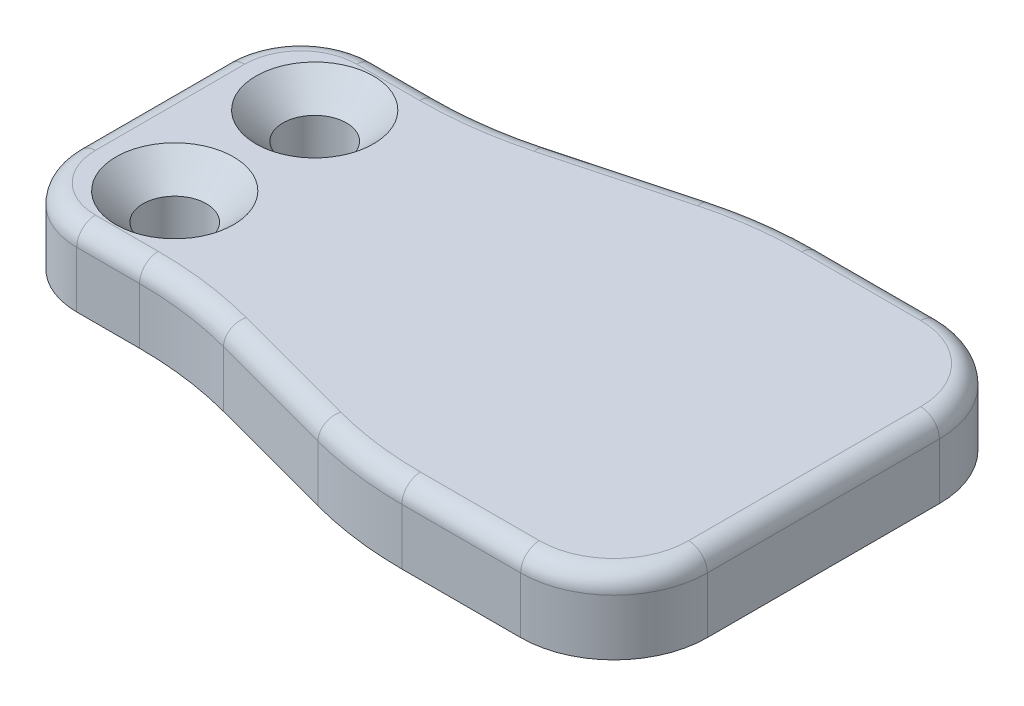
ISO-10303-21;
HEADER;
FILE_DESCRIPTION(('STEP AP214'),'2;1');
FILE_NAME('part.step','',(''),(''),'','','');
FILE_SCHEMA(('AUTOMOTIVE_DESIGN { 1 0 10303 214 1 1 1 1 }'));
ENDSEC;
DATA;
#1=APPLICATION_CONTEXT('core data for automotive mechanical design processes');
#2=APPLICATION_PROTOCOL_DEFINITION('international standard','automotive_design',2000,#1);
#3=PRODUCT_CONTEXT('',#1,'mechanical');
#4=PRODUCT('Part','Part','',(#3));
#5=PRODUCT_RELATED_PRODUCT_CATEGORY('part','',(#4));
#6=PRODUCT_DEFINITION_FORMATION('','',#4);
#7=PRODUCT_DEFINITION_CONTEXT('part definition',#1,'design');
#8=PRODUCT_DEFINITION('design','',#6,#7);
#9=PRODUCT_DEFINITION_SHAPE('','',#8);
#10=(LENGTH_UNIT() NAMED_UNIT(*) SI_UNIT(.MILLI.,.METRE.));
#11=(NAMED_UNIT(*) PLANE_ANGLE_UNIT() SI_UNIT($,.RADIAN.));
#12=(NAMED_UNIT(*) SI_UNIT($,.STERADIAN.) SOLID_ANGLE_UNIT());
#13=UNCERTAINTY_MEASURE_WITH_UNIT(LENGTH_MEASURE(1.E-05),#10,'distance_accuracy_value','');
#14=(GEOMETRIC_REPRESENTATION_CONTEXT(3) GLOBAL_UNCERTAINTY_ASSIGNED_CONTEXT((#13)) GLOBAL_UNIT_ASSIGNED_CONTEXT((#10,
#11,#12)) REPRESENTATION_CONTEXT('',''));
#15=CARTESIAN_POINT('',(0.,0.,0.));
#16=DIRECTION('',(0.,0.,1.));
#17=DIRECTION('',(1.,0.,0.));
#18=AXIS2_PLACEMENT_3D('',#15,#16,#17);
#19=CARTESIAN_POINT('',(36.,-2.,0.));
#20=DIRECTION('',(1.,0.,0.));
#21=DIRECTION('',(0.,0.,-1.));
#22=AXIS2_PLACEMENT_3D('',#19,#20,#21);
#23=PLANE('',#22);
#24=DIRECTION('',(0.,-1.,0.));
#25=VECTOR('',#24,1.);
#26=CARTESIAN_POINT('',(36.,-2.,31.7596196090394));
#27=LINE('',#26,#25);
#28=CARTESIAN_POINT('',(36.,-6.,31.7596196090394));
#29=VERTEX_POINT('',#28);
#30=CARTESIAN_POINT('',(36.,-3.,31.7596196090394));
#31=VERTEX_POINT('',#30);
#32=EDGE_CURVE('E289',#29,#31,#27,.F.);
#33=ORIENTED_EDGE('',*,*,#32,.T.);
#34=DIRECTION('',(0.,0.,1.));
#35=VECTOR('',#34,1.);
#36=CARTESIAN_POINT('',(36.,-3.,44.1904002273864));
#37=LINE('',#36,#35);
#38=CARTESIAN_POINT('',(36.,-3.,44.1904002273864));
#39=VERTEX_POINT('',#38);
#40=EDGE_CURVE('E11',#31,#39,#37,.T.);
#41=ORIENTED_EDGE('',*,*,#40,.T.);
#42=DIRECTION('',(0.,-1.,0.));
#43=VECTOR('',#42,1.);
#44=CARTESIAN_POINT('',(36.,-6.,44.1904002273864));
#45=LINE('',#44,#43);
#46=CARTESIAN_POINT('',(36.,-6.,44.1904002273864));
#47=VERTEX_POINT('',#46);
#48=EDGE_CURVE('E291',#39,#47,#45,.T.);
#49=ORIENTED_EDGE('',*,*,#48,.T.);
#50=DIRECTION('',(0.,0.,1.));
#51=VECTOR('',#50,1.);
#52=CARTESIAN_POINT('',(36.,-6.,0.));
#53=LINE('',#52,#51);
#54=EDGE_CURVE('E250',#29,#47,#53,.T.);
#55=ORIENTED_EDGE('',*,*,#54,.F.);
#56=EDGE_LOOP('',(#33,#41,#49,#55));
#57=FACE_BOUND('',#56,.T.);
#58=ADVANCED_FACE('F39',(#57),#23,.T.);
#59=CARTESIAN_POINT('',(0.,-2.,26.7596196090394));
#60=DIRECTION('',(0.,0.,-1.));
#61=DIRECTION('',(-1.,0.,0.));
#62=AXIS2_PLACEMENT_3D('',#59,#60,#61);
#63=PLANE('',#62);
#64=DIRECTION('',(0.,-1.,0.));
#65=VECTOR('',#64,1.);
#66=CARTESIAN_POINT('',(24.6330499517479,-2.,26.7596196090394));
#67=LINE('',#66,#65);
#68=CARTESIAN_POINT('',(24.6330499517479,-6.,26.7596196090394));
#69=VERTEX_POINT('',#68);
#70=CARTESIAN_POINT('',(24.6330499517479,-3.,26.7596196090394));
#71=VERTEX_POINT('',#70);
#72=EDGE_CURVE('E281',#69,#71,#67,.F.);
#73=ORIENTED_EDGE('',*,*,#72,.T.);
#74=DIRECTION('',(1.,0.,0.));
#75=VECTOR('',#74,1.);
#76=CARTESIAN_POINT('',(31.,-3.,26.7596196090394));
#77=LINE('',#76,#75);
#78=CARTESIAN_POINT('',(31.,-3.,26.7596196090394));
#79=VERTEX_POINT('',#78);
#80=EDGE_CURVE('E337',#71,#79,#77,.T.);
#81=ORIENTED_EDGE('',*,*,#80,.T.);
#82=DIRECTION('',(0.,-1.,0.));
#83=VECTOR('',#82,1.);
#84=CARTESIAN_POINT('',(31.,-2.,26.7596196090394));
#85=LINE('',#84,#83);
#86=CARTESIAN_POINT('',(31.,-6.,26.7596196090394));
#87=VERTEX_POINT('',#86);
#88=EDGE_CURVE('E299',#79,#87,#85,.T.);
#89=ORIENTED_EDGE('',*,*,#88,.T.);
#90=DIRECTION('',(1.,0.,0.));
#91=VECTOR('',#90,1.);
#92=CARTESIAN_POINT('',(0.,-6.,26.7596196090394));
#93=LINE('',#92,#91);
#94=EDGE_CURVE('E213',#69,#87,#93,.T.);
#95=ORIENTED_EDGE('',*,*,#94,.F.);
#96=EDGE_LOOP('',(#73,#81,#89,#95));
#97=FACE_BOUND('',#96,.T.);
#98=ADVANCED_FACE('F532',(#97),#63,.T.);
#99=CARTESIAN_POINT('',(8.16362546063105,-2.,30.4670649930379));
#100=DIRECTION('',(-0.258819045102521,0.,-0.965925826289068));
#101=DIRECTION('',(-0.965925826289068,0.,0.258819045102521));
#102=AXIS2_PLACEMENT_3D('',#99,#100,#101);
#103=PLANE('',#102);
#104=DIRECTION('',(0.,-1.,0.));
#105=VECTOR('',#104,1.);
#106=CARTESIAN_POINT('',(12.5433309503025,-2.,29.2935264439943));
#107=LINE('',#106,#105);
#108=CARTESIAN_POINT('',(12.5433309503025,-6.,29.2935264439943));
#109=VERTEX_POINT('',#108);
#110=CARTESIAN_POINT('',(12.5433309503025,-3.,29.2935264439943));
#111=VERTEX_POINT('',#110);
#112=EDGE_CURVE('E276',#109,#111,#107,.F.);
#113=ORIENTED_EDGE('',*,*,#112,.T.);
#114=DIRECTION('',(0.965925826289068,0.,-0.258819045102521));
#115=VECTOR('',#114,1.);
#116=CARTESIAN_POINT('',(19.4566690496975,-3.,27.441103083258));
#117=LINE('',#116,#115);
#118=CARTESIAN_POINT('',(19.4566690496975,-3.,27.441103083258));
#119=VERTEX_POINT('',#118);
#120=EDGE_CURVE('E341',#111,#119,#117,.T.);
#121=ORIENTED_EDGE('',*,*,#120,.T.);
#122=DIRECTION('',(0.,-1.,0.));
#123=VECTOR('',#122,1.);
#124=CARTESIAN_POINT('',(19.4566690496975,-2.,27.441103083258));
#125=LINE('',#124,#123);
#126=CARTESIAN_POINT('',(19.4566690496975,-6.,27.441103083258));
#127=VERTEX_POINT('',#126);
#128=EDGE_CURVE('E279',#119,#127,#125,.T.);
#129=ORIENTED_EDGE('',*,*,#128,.T.);
#130=DIRECTION('',(0.965925826289068,0.,-0.258819045102521));
#131=VECTOR('',#130,1.);
#132=CARTESIAN_POINT('',(8.16362546063105,-6.,30.4670649930379));
#133=LINE('',#132,#131);
#134=EDGE_CURVE('E242',#109,#127,#133,.T.);
#135=ORIENTED_EDGE('',*,*,#134,.F.);
#136=EDGE_LOOP('',(#113,#121,#129,#135));
#137=FACE_BOUND('',#136,.T.);
#138=ADVANCED_FACE('F521',(#137),#103,.T.);
#139=CARTESIAN_POINT('',(0.,-2.,29.9750099182129));
#140=DIRECTION('',(0.,0.,-1.));
#141=DIRECTION('',(-1.,0.,0.));
#142=AXIS2_PLACEMENT_3D('',#139,#140,#141);
#143=PLANE('',#142);
#144=DIRECTION('',(0.,-1.,0.));
#145=VECTOR('',#144,1.);
#146=CARTESIAN_POINT('',(4.,-2.,29.9750099182129));
#147=LINE('',#146,#145);
#148=CARTESIAN_POINT('',(4.,-6.,29.9750099182129));
#149=VERTEX_POINT('',#148);
#150=CARTESIAN_POINT('',(4.,-3.,29.9750099182129));
#151=VERTEX_POINT('',#150);
#152=EDGE_CURVE('E260',#149,#151,#147,.F.);
#153=ORIENTED_EDGE('',*,*,#152,.T.);
#154=DIRECTION('',(1.,0.,0.));
#155=VECTOR('',#154,1.);
#156=CARTESIAN_POINT('',(7.36695004825207,-3.,29.9750099182129));
#157=LINE('',#156,#155);
#158=CARTESIAN_POINT('',(7.36695004825207,-3.,29.9750099182129));
#159=VERTEX_POINT('',#158);
#160=EDGE_CURVE('E345',#151,#159,#157,.T.);
#161=ORIENTED_EDGE('',*,*,#160,.T.);
#162=DIRECTION('',(0.,-1.,0.));
#163=VECTOR('',#162,1.);
#164=CARTESIAN_POINT('',(7.36695004825207,-6.,29.9750099182129));
#165=LINE('',#164,#163);
#166=CARTESIAN_POINT('',(7.36695004825207,-6.,29.9750099182129));
#167=VERTEX_POINT('',#166);
#168=EDGE_CURVE('E284',#159,#167,#165,.T.);
#169=ORIENTED_EDGE('',*,*,#168,.T.);
#170=DIRECTION('',(1.,0.,0.));
#171=VECTOR('',#170,1.);
#172=CARTESIAN_POINT('',(0.,-6.,29.9750099182129));
#173=LINE('',#172,#171);
#174=EDGE_CURVE('E233',#149,#167,#173,.T.);
#175=ORIENTED_EDGE('',*,*,#174,.F.);
#176=EDGE_LOOP('',(#153,#161,#169,#175));
#177=FACE_BOUND('',#176,.T.);
#178=ADVANCED_FACE('F500',(#177),#143,.T.);
#179=CARTESIAN_POINT('',(0.,-2.,0.));
#180=DIRECTION('',(-1.,0.,0.));
#181=DIRECTION('',(0.,0.,1.));
#182=AXIS2_PLACEMENT_3D('',#179,#180,#181);
#183=PLANE('',#182);
#184=DIRECTION('',(0.,-1.,0.));
#185=VECTOR('',#184,1.);
#186=CARTESIAN_POINT('',(0.,-2.,41.9750099182129));
#187=LINE('',#186,#185);
#188=CARTESIAN_POINT('',(0.,-6.,41.9750099182129));
#189=VERTEX_POINT('',#188);
#190=CARTESIAN_POINT('',(0.,-3.,41.9750099182129));
#191=VERTEX_POINT('',#190);
#192=EDGE_CURVE('E219',#189,#191,#187,.F.);
#193=ORIENTED_EDGE('',*,*,#192,.T.);
#194=DIRECTION('',(0.,0.,-1.));
#195=VECTOR('',#194,1.);
#196=CARTESIAN_POINT('',(0.,-3.,33.9750099182129));
#197=LINE('',#196,#195);
#198=CARTESIAN_POINT('',(0.,-3.,33.9750099182129));
#199=VERTEX_POINT('',#198);
#200=EDGE_CURVE('E349',#191,#199,#197,.T.);
#201=ORIENTED_EDGE('',*,*,#200,.T.);
#202=DIRECTION('',(0.,-1.,0.));
#203=VECTOR('',#202,1.);
#204=CARTESIAN_POINT('',(0.,-2.,33.9750099182129));
#205=LINE('',#204,#203);
#206=CARTESIAN_POINT('',(0.,-6.,33.9750099182129));
#207=VERTEX_POINT('',#206);
#208=EDGE_CURVE('E223',#199,#207,#205,.T.);
#209=ORIENTED_EDGE('',*,*,#208,.T.);
#210=DIRECTION('',(0.,0.,-1.));
#211=VECTOR('',#210,1.);
#212=CARTESIAN_POINT('',(0.,-6.,0.));
#213=LINE('',#212,#211);
#214=EDGE_CURVE('E230',#189,#207,#213,.T.);
#215=ORIENTED_EDGE('',*,*,#214,.F.);
#216=EDGE_LOOP('',(#193,#201,#209,#215));
#217=FACE_BOUND('',#216,.T.);
#218=ADVANCED_FACE('F493',(#217),#183,.T.);
#219=CARTESIAN_POINT('',(0.,-2.,45.9750099182129));
#220=DIRECTION('',(0.,0.,-1.));
#221=DIRECTION('',(-1.,0.,0.));
#222=AXIS2_PLACEMENT_3D('',#219,#220,#221);
#223=PLANE('',#222);
#224=DIRECTION('',(0.,-1.,0.));
#225=VECTOR('',#224,1.);
#226=CARTESIAN_POINT('',(7.36695004825208,-2.,45.9750099182129));
#227=LINE('',#226,#225);
#228=CARTESIAN_POINT('',(7.36695004825208,-6.,45.9750099182129));
#229=VERTEX_POINT('',#228);
#230=CARTESIAN_POINT('',(7.36695004825208,-3.,45.9750099182129));
#231=VERTEX_POINT('',#230);
#232=EDGE_CURVE('E274',#229,#231,#227,.F.);
#233=ORIENTED_EDGE('',*,*,#232,.T.);
#234=DIRECTION('',(1.,0.,0.));
#235=VECTOR('',#234,1.);
#236=CARTESIAN_POINT('',(0.,-3.,45.9750099182129));
#237=LINE('',#236,#235);
#238=CARTESIAN_POINT('',(4.,-3.,45.9750099182129));
#239=VERTEX_POINT('',#238);
#240=EDGE_CURVE('E209',#231,#239,#237,.F.);
#241=ORIENTED_EDGE('',*,*,#240,.T.);
#242=DIRECTION('',(0.,-1.,0.));
#243=VECTOR('',#242,1.);
#244=CARTESIAN_POINT('',(4.,-6.,45.9750099182129));
#245=LINE('',#244,#243);
#246=CARTESIAN_POINT('',(4.,-6.,45.9750099182129));
#247=VERTEX_POINT('',#246);
#248=EDGE_CURVE('E201',#239,#247,#245,.T.);
#249=ORIENTED_EDGE('',*,*,#248,.T.);
#250=DIRECTION('',(1.,0.,0.));
#251=VECTOR('',#250,1.);
#252=CARTESIAN_POINT('',(0.,-6.,45.9750099182129));
#253=LINE('',#252,#251);
#254=EDGE_CURVE('E206',#247,#229,#253,.T.);
#255=ORIENTED_EDGE('',*,*,#254,.T.);
#256=EDGE_LOOP('',(#233,#241,#249,#255));
#257=FACE_BOUND('',#256,.T.);
#258=ADVANCED_FACE('F204',(#257),#223,.F.);
#259=CARTESIAN_POINT('',(-10.8238794984754,-2.,40.3952682233134));
#260=DIRECTION('',(0.258819045102521,0.,-0.965925826289068));
#261=DIRECTION('',(-0.965925826289068,0.,-0.258819045102521));
#262=AXIS2_PLACEMENT_3D('',#259,#260,#261);
#263=PLANE('',#262);
#264=DIRECTION('',(0.,-1.,0.));
#265=VECTOR('',#264,1.);
#266=CARTESIAN_POINT('',(19.4566690496975,-2.,48.5089167531677));
#267=LINE('',#266,#265);
#268=CARTESIAN_POINT('',(19.4566690496975,-6.,48.5089167531677));
#269=VERTEX_POINT('',#268);
#270=CARTESIAN_POINT('',(19.4566690496975,-3.,48.5089167531677));
#271=VERTEX_POINT('',#270);
#272=EDGE_CURVE('E271',#269,#271,#267,.F.);
#273=ORIENTED_EDGE('',*,*,#272,.T.);
#274=DIRECTION('',(0.965925826289068,0.,0.258819045102521));
#275=VECTOR('',#274,1.);
#276=CARTESIAN_POINT('',(-10.8238794984754,-3.,40.3952682233134));
#277=LINE('',#276,#275);
#278=CARTESIAN_POINT('',(12.5433309503025,-3.,46.6564933924315));
#279=VERTEX_POINT('',#278);
#280=EDGE_CURVE('E356',#271,#279,#277,.F.);
#281=ORIENTED_EDGE('',*,*,#280,.T.);
#282=DIRECTION('',(0.,-1.,0.));
#283=VECTOR('',#282,1.);
#284=CARTESIAN_POINT('',(12.5433309503025,-6.,46.6564933924315));
#285=LINE('',#284,#283);
#286=CARTESIAN_POINT('',(12.5433309503025,-6.,46.6564933924315));
#287=VERTEX_POINT('',#286);
#288=EDGE_CURVE('E269',#279,#287,#285,.T.);
#289=ORIENTED_EDGE('',*,*,#288,.T.);
#290=DIRECTION('',(0.965925826289068,0.,0.258819045102521));
#291=VECTOR('',#290,1.);
#292=CARTESIAN_POINT('',(-10.8238794984754,-6.,40.3952682233134));
#293=LINE('',#292,#291);
#294=EDGE_CURVE('E231',#287,#269,#293,.T.);
#295=ORIENTED_EDGE('',*,*,#294,.T.);
#296=EDGE_LOOP('',(#273,#281,#289,#295));
#297=FACE_BOUND('',#296,.T.);
#298=ADVANCED_FACE('F481',(#297),#263,.F.);
#299=CARTESIAN_POINT('',(0.,-2.,49.1904002273864));
#300=DIRECTION('',(0.,0.,-1.));
#301=DIRECTION('',(-1.,0.,0.));
#302=AXIS2_PLACEMENT_3D('',#299,#300,#301);
#303=PLANE('',#302);
#304=DIRECTION('',(0.,-1.,0.));
#305=VECTOR('',#304,1.);
#306=CARTESIAN_POINT('',(31.,-2.,49.1904002273864));
#307=LINE('',#306,#305);
#308=CARTESIAN_POINT('',(31.,-6.,49.1904002273864));
#309=VERTEX_POINT('',#308);
#310=CARTESIAN_POINT('',(31.,-3.,49.1904002273864));
#311=VERTEX_POINT('',#310);
#312=EDGE_CURVE('E297',#309,#311,#307,.F.);
#313=ORIENTED_EDGE('',*,*,#312,.T.);
#314=DIRECTION('',(1.,0.,0.));
#315=VECTOR('',#314,1.);
#316=CARTESIAN_POINT('',(0.,-3.,49.1904002273864));
#317=LINE('',#316,#315);
#318=CARTESIAN_POINT('',(24.6330499517479,-3.,49.1904002273864));
#319=VERTEX_POINT('',#318);
#320=EDGE_CURVE('E360',#311,#319,#317,.F.);
#321=ORIENTED_EDGE('',*,*,#320,.T.);
#322=DIRECTION('',(0.,-1.,0.));
#323=VECTOR('',#322,1.);
#324=CARTESIAN_POINT('',(24.6330499517479,-2.,49.1904002273864));
#325=LINE('',#324,#323);
#326=CARTESIAN_POINT('',(24.6330499517479,-6.,49.1904002273864));
#327=VERTEX_POINT('',#326);
#328=EDGE_CURVE('E263',#319,#327,#325,.T.);
#329=ORIENTED_EDGE('',*,*,#328,.T.);
#330=DIRECTION('',(1.,0.,0.));
#331=VECTOR('',#330,1.);
#332=CARTESIAN_POINT('',(0.,-6.,49.1904002273864));
#333=LINE('',#332,#331);
#334=EDGE_CURVE('E236',#327,#309,#333,.T.);
#335=ORIENTED_EDGE('',*,*,#334,.T.);
#336=EDGE_LOOP('',(#313,#321,#329,#335));
#337=FACE_BOUND('',#336,.T.);
#338=ADVANCED_FACE('F427',(#337),#303,.F.);
#339=CARTESIAN_POINT('',(0.,-2.,0.));
#340=DIRECTION('',(0.,-1.,0.));
#341=DIRECTION('',(0.,0.,-1.));
#342=AXIS2_PLACEMENT_3D('',#339,#340,#341);
#343=PLANE('',#342);
#344=DIRECTION('',(0.,0.,1.));
#345=VECTOR('',#344,1.);
#346=CARTESIAN_POINT('',(35.,-2.,31.7596196090394));
#347=LINE('',#346,#345);
#348=CARTESIAN_POINT('',(35.,-2.,44.1904002273864));
#349=VERTEX_POINT('',#348);
#350=CARTESIAN_POINT('',(35.,-2.,31.7596196090394));
#351=VERTEX_POINT('',#350);
#352=EDGE_CURVE('E301',#349,#351,#347,.F.);
#353=ORIENTED_EDGE('',*,*,#352,.T.);
#354=CARTESIAN_POINT('',(31.,-2.,31.7596196090394));
#355=DIRECTION('',(0.,-1.,0.));
#356=DIRECTION('',(0.,0.,-1.));
#357=AXIS2_PLACEMENT_3D('',#354,#355,#356);
#358=CIRCLE('',#357,4.);
#359=CARTESIAN_POINT('',(31.,-2.,27.7596196090394));
#360=VERTEX_POINT('',#359);
#361=EDGE_CURVE('E331',#351,#360,#358,.F.);
#362=ORIENTED_EDGE('',*,*,#361,.T.);
#363=DIRECTION('',(1.,0.,0.));
#364=VECTOR('',#363,1.);
#365=CARTESIAN_POINT('',(24.6330499517479,-2.,27.7596196090394));
#366=LINE('',#365,#364);
#367=CARTESIAN_POINT('',(24.6330499517479,-2.,27.7596196090394));
#368=VERTEX_POINT('',#367);
#369=EDGE_CURVE('E329',#360,#368,#366,.F.);
#370=ORIENTED_EDGE('',*,*,#369,.T.);
#371=CARTESIAN_POINT('',(24.6330499517479,-2.,46.7596196090394));
#372=DIRECTION('',(0.,-1.,0.));
#373=DIRECTION('',(0.,0.,-1.));
#374=AXIS2_PLACEMENT_3D('',#371,#372,#373);
#375=CIRCLE('',#374,19.);
#376=CARTESIAN_POINT('',(19.7154880948,-2.,28.4070289095471));
#377=VERTEX_POINT('',#376);
#378=EDGE_CURVE('E327',#368,#377,#375,.F.);
#379=ORIENTED_EDGE('',*,*,#378,.T.);
#380=DIRECTION('',(0.965925826289068,0.,-0.258819045102521));
#381=VECTOR('',#380,1.);
#382=CARTESIAN_POINT('',(12.802149995405,-2.,30.2594522702833));
#383=LINE('',#382,#381);
#384=CARTESIAN_POINT('',(12.802149995405,-2.,30.2594522702833));
#385=VERTEX_POINT('',#384);
#386=EDGE_CURVE('E325',#377,#385,#383,.F.);
#387=ORIENTED_EDGE('',*,*,#386,.T.);
#388=CARTESIAN_POINT('',(7.36695004825207,-2.,9.97500991821289));
#389=DIRECTION('',(0.,-1.,0.));
#390=DIRECTION('',(0.,0.,-1.));
#391=AXIS2_PLACEMENT_3D('',#388,#389,#390);
#392=CIRCLE('',#391,21.);
#393=CARTESIAN_POINT('',(7.36695004825207,-2.,30.9750099182129));
#394=VERTEX_POINT('',#393);
#395=EDGE_CURVE('E323',#385,#394,#392,.T.);
#396=ORIENTED_EDGE('',*,*,#395,.T.);
#397=DIRECTION('',(1.,0.,0.));
#398=VECTOR('',#397,1.);
#399=CARTESIAN_POINT('',(4.,-2.,30.9750099182129));
#400=LINE('',#399,#398);
#401=CARTESIAN_POINT('',(4.,-2.,30.9750099182129));
#402=VERTEX_POINT('',#401);
#403=EDGE_CURVE('E321',#394,#402,#400,.F.);
#404=ORIENTED_EDGE('',*,*,#403,.T.);
#405=CARTESIAN_POINT('',(4.,-2.,33.9750099182129));
#406=DIRECTION('',(0.,-1.,0.));
#407=DIRECTION('',(0.,0.,-1.));
#408=AXIS2_PLACEMENT_3D('',#405,#406,#407);
#409=CIRCLE('',#408,3.);
#410=CARTESIAN_POINT('',(1.,-2.,33.9750099182129));
#411=VERTEX_POINT('',#410);
#412=EDGE_CURVE('E319',#402,#411,#409,.F.);
#413=ORIENTED_EDGE('',*,*,#412,.T.);
#414=DIRECTION('',(0.,0.,-1.));
#415=VECTOR('',#414,1.);
#416=CARTESIAN_POINT('',(1.,-2.,41.9750099182129));
#417=LINE('',#416,#415);
#418=CARTESIAN_POINT('',(1.,-2.,41.9750099182129));
#419=VERTEX_POINT('',#418);
#420=EDGE_CURVE('E317',#411,#419,#417,.F.);
#421=ORIENTED_EDGE('',*,*,#420,.T.);
#422=CARTESIAN_POINT('',(4.,-2.,41.9750099182129));
#423=DIRECTION('',(0.,-1.,0.));
#424=DIRECTION('',(0.,0.,-1.));
#425=AXIS2_PLACEMENT_3D('',#422,#423,#424);
#426=CIRCLE('',#425,3.);
#427=CARTESIAN_POINT('',(4.,-2.,44.9750099182129));
#428=VERTEX_POINT('',#427);
#429=EDGE_CURVE('E315',#419,#428,#426,.F.);
#430=ORIENTED_EDGE('',*,*,#429,.T.);
#431=DIRECTION('',(1.,0.,0.));
#432=VECTOR('',#431,1.);
#433=CARTESIAN_POINT('',(0.,-2.,44.9750099182129));
#434=LINE('',#433,#432);
#435=CARTESIAN_POINT('',(7.36695004825208,-2.,44.9750099182129));
#436=VERTEX_POINT('',#435);
#437=EDGE_CURVE('E313',#428,#436,#434,.T.);
#438=ORIENTED_EDGE('',*,*,#437,.T.);
#439=CARTESIAN_POINT('',(7.36695004825208,-2.,65.9750099182129));
#440=DIRECTION('',(0.,-1.,0.));
#441=DIRECTION('',(0.,0.,-1.));
#442=AXIS2_PLACEMENT_3D('',#439,#440,#441);
#443=CIRCLE('',#442,21.);
#444=CARTESIAN_POINT('',(12.802149995405,-2.,45.6905675661425));
#445=VERTEX_POINT('',#444);
#446=EDGE_CURVE('E311',#436,#445,#443,.T.);
#447=ORIENTED_EDGE('',*,*,#446,.T.);
#448=DIRECTION('',(0.965925826289068,0.,0.258819045102521));
#449=VECTOR('',#448,1.);
#450=CARTESIAN_POINT('',(-10.5650604533729,-2.,39.4293423970243));
#451=LINE('',#450,#449);
#452=CARTESIAN_POINT('',(19.7154880948,-2.,47.5429909268787));
#453=VERTEX_POINT('',#452);
#454=EDGE_CURVE('E309',#445,#453,#451,.T.);
#455=ORIENTED_EDGE('',*,*,#454,.T.);
#456=CARTESIAN_POINT('',(24.6330499517479,-2.,29.1904002273864));
#457=DIRECTION('',(0.,-1.,0.));
#458=DIRECTION('',(0.,0.,-1.));
#459=AXIS2_PLACEMENT_3D('',#456,#457,#458);
#460=CIRCLE('',#459,19.);
#461=CARTESIAN_POINT('',(24.6330499517479,-2.,48.1904002273864));
#462=VERTEX_POINT('',#461);
#463=EDGE_CURVE('E307',#453,#462,#460,.F.);
#464=ORIENTED_EDGE('',*,*,#463,.T.);
#465=DIRECTION('',(1.,0.,0.));
#466=VECTOR('',#465,1.);
#467=CARTESIAN_POINT('',(0.,-2.,48.1904002273864));
#468=LINE('',#467,#466);
#469=CARTESIAN_POINT('',(31.,-2.,48.1904002273864));
#470=VERTEX_POINT('',#469);
#471=EDGE_CURVE('E305',#462,#470,#468,.T.);
#472=ORIENTED_EDGE('',*,*,#471,.T.);
#473=CARTESIAN_POINT('',(31.,-2.,44.1904002273864));
#474=DIRECTION('',(0.,-1.,0.));
#475=DIRECTION('',(0.,0.,-1.));
#476=AXIS2_PLACEMENT_3D('',#473,#474,#475);
#477=CIRCLE('',#476,4.);
#478=EDGE_CURVE('E303',#470,#349,#477,.F.);
#479=ORIENTED_EDGE('',*,*,#478,.T.);
#480=EDGE_LOOP('',(#353,#362,#370,#379,#387,#396,#404,#413,#421,#430,#438,#447,#455,#464,#472,#479));
#481=FACE_BOUND('',#480,.T.);
#482=CARTESIAN_POINT('',(5.,-2.,41.7250099182126));
#483=DIRECTION('',(0.,1.,0.));
#484=DIRECTION('',(0.,0.,1.));
#485=AXIS2_PLACEMENT_3D('',#482,#483,#484);
#486=CIRCLE('',#485,3.15);
#487=CARTESIAN_POINT('',(5.,-2.,44.8750099182126));
#488=VERTEX_POINT('',#487);
#489=EDGE_CURVE('E409',#488,#488,#486,.T.);
#490=ORIENTED_EDGE('',*,*,#489,.F.);
#491=EDGE_LOOP('',(#490));
#492=FACE_BOUND('',#491,.T.);
#493=CARTESIAN_POINT('',(5.,-2.,34.2250099182126));
#494=DIRECTION('',(0.,1.,0.));
#495=DIRECTION('',(0.,0.,1.));
#496=AXIS2_PLACEMENT_3D('',#493,#494,#495);
#497=CIRCLE('',#496,3.15);
#498=CARTESIAN_POINT('',(5.,-2.,37.3750099182126));
#499=VERTEX_POINT('',#498);
#500=EDGE_CURVE('E254',#499,#499,#497,.T.);
#501=ORIENTED_EDGE('',*,*,#500,.F.);
#502=EDGE_LOOP('',(#501));
#503=FACE_BOUND('',#502,.T.);
#504=ADVANCED_FACE('F452',(#481,#492,#503),#343,.F.);
#505=CARTESIAN_POINT('',(0.,-6.,0.));
#506=DIRECTION('',(0.,-1.,0.));
#507=DIRECTION('',(0.,0.,-1.));
#508=AXIS2_PLACEMENT_3D('',#505,#506,#507);
#509=PLANE('',#508);
#510=CARTESIAN_POINT('',(5.,-6.,41.7250099182126));
#511=DIRECTION('',(0.,-1.,0.));
#512=DIRECTION('',(0.,0.,-1.));
#513=AXIS2_PLACEMENT_3D('',#510,#511,#512);
#514=CIRCLE('',#513,1.69999999999999);
#515=CARTESIAN_POINT('',(5.,-6.,40.0250099182126));
#516=VERTEX_POINT('',#515);
#517=EDGE_CURVE('E252',#516,#516,#514,.T.);
#518=ORIENTED_EDGE('',*,*,#517,.F.);
#519=EDGE_LOOP('',(#518));
#520=FACE_BOUND('',#519,.T.);
#521=CARTESIAN_POINT('',(5.,-6.,34.2250099182126));
#522=DIRECTION('',(0.,-1.,0.));
#523=DIRECTION('',(0.,0.,-1.));
#524=AXIS2_PLACEMENT_3D('',#521,#522,#523);
#525=CIRCLE('',#524,1.69999999999999);
#526=CARTESIAN_POINT('',(5.,-6.,32.5250099182126));
#527=VERTEX_POINT('',#526);
#528=EDGE_CURVE('E247',#527,#527,#525,.T.);
#529=ORIENTED_EDGE('',*,*,#528,.F.);
#530=EDGE_LOOP('',(#529));
#531=FACE_BOUND('',#530,.T.);
#532=ORIENTED_EDGE('',*,*,#54,.T.);
#533=CARTESIAN_POINT('',(31.,-6.,44.1904002273864));
#534=DIRECTION('',(0.,-1.,0.));
#535=DIRECTION('',(0.,0.,-1.));
#536=AXIS2_PLACEMENT_3D('',#533,#534,#535);
#537=CIRCLE('',#536,5.);
#538=EDGE_CURVE('E295',#47,#309,#537,.T.);
#539=ORIENTED_EDGE('',*,*,#538,.T.);
#540=ORIENTED_EDGE('',*,*,#334,.F.);
#541=CARTESIAN_POINT('',(24.6330499517479,-6.,29.1904002273864));
#542=DIRECTION('',(0.,-1.,0.));
#543=DIRECTION('',(0.,0.,-1.));
#544=AXIS2_PLACEMENT_3D('',#541,#542,#543);
#545=CIRCLE('',#544,20.);
#546=EDGE_CURVE('E267',#327,#269,#545,.T.);
#547=ORIENTED_EDGE('',*,*,#546,.T.);
#548=ORIENTED_EDGE('',*,*,#294,.F.);
#549=CARTESIAN_POINT('',(7.36695004825208,-6.,65.9750099182129));
#550=DIRECTION('',(0.,-1.,0.));
#551=DIRECTION('',(0.,0.,-1.));
#552=AXIS2_PLACEMENT_3D('',#549,#550,#551);
#553=CIRCLE('',#552,20.);
#554=EDGE_CURVE('E229',#287,#229,#553,.F.);
#555=ORIENTED_EDGE('',*,*,#554,.T.);
#556=ORIENTED_EDGE('',*,*,#254,.F.);
#557=CARTESIAN_POINT('',(4.,-6.,41.9750099182129));
#558=DIRECTION('',(0.,-1.,0.));
#559=DIRECTION('',(0.,0.,-1.));
#560=AXIS2_PLACEMENT_3D('',#557,#558,#559);
#561=CIRCLE('',#560,4.);
#562=EDGE_CURVE('E216',#247,#189,#561,.T.);
#563=ORIENTED_EDGE('',*,*,#562,.T.);
#564=ORIENTED_EDGE('',*,*,#214,.T.);
#565=CARTESIAN_POINT('',(4.,-6.,33.9750099182129));
#566=DIRECTION('',(0.,-1.,0.));
#567=DIRECTION('',(0.,0.,-1.));
#568=AXIS2_PLACEMENT_3D('',#565,#566,#567);
#569=CIRCLE('',#568,4.);
#570=EDGE_CURVE('E212',#207,#149,#569,.T.);
#571=ORIENTED_EDGE('',*,*,#570,.T.);
#572=ORIENTED_EDGE('',*,*,#174,.T.);
#573=CARTESIAN_POINT('',(7.36695004825207,-6.,9.97500991821289));
#574=DIRECTION('',(0.,-1.,0.));
#575=DIRECTION('',(0.,0.,-1.));
#576=AXIS2_PLACEMENT_3D('',#573,#574,#575);
#577=CIRCLE('',#576,20.);
#578=EDGE_CURVE('E287',#167,#109,#577,.F.);
#579=ORIENTED_EDGE('',*,*,#578,.T.);
#580=ORIENTED_EDGE('',*,*,#134,.T.);
#581=CARTESIAN_POINT('',(24.6330499517479,-6.,46.7596196090394));
#582=DIRECTION('',(0.,-1.,0.));
#583=DIRECTION('',(0.,0.,-1.));
#584=AXIS2_PLACEMENT_3D('',#581,#582,#583);
#585=CIRCLE('',#584,20.);
#586=EDGE_CURVE('E265',#127,#69,#585,.T.);
#587=ORIENTED_EDGE('',*,*,#586,.T.);
#588=ORIENTED_EDGE('',*,*,#94,.T.);
#589=CARTESIAN_POINT('',(31.,-6.,31.7596196090394));
#590=DIRECTION('',(0.,-1.,0.));
#591=DIRECTION('',(0.,0.,-1.));
#592=AXIS2_PLACEMENT_3D('',#589,#590,#591);
#593=CIRCLE('',#592,5.);
#594=EDGE_CURVE('E293',#87,#29,#593,.T.);
#595=ORIENTED_EDGE('',*,*,#594,.T.);
#596=EDGE_LOOP('',(#532,#539,#540,#547,#548,#555,#556,#563,#564,#571,#572,#579,#580,#587,#588,#595));
#597=FACE_BOUND('',#596,.T.);
#598=ADVANCED_FACE('F226',(#520,#531,#597),#509,.T.);
#599=CARTESIAN_POINT('',(5.,-2.,34.2250099182126));
#600=DIRECTION('',(0.,1.,0.));
#601=DIRECTION('',(0.,0.,1.));
#602=AXIS2_PLACEMENT_3D('',#599,#600,#601);
#603=CYLINDRICAL_SURFACE('',#602,1.69999999999999);
#604=ORIENTED_EDGE('',*,*,#528,.T.);
#605=EDGE_LOOP('',(#604));
#606=FACE_BOUND('',#605,.T.);
#607=CARTESIAN_POINT('',(5.,-3.45000000000001,34.2250099182126));
#608=DIRECTION('',(0.,1.,0.));
#609=DIRECTION('',(0.,0.,1.));
#610=AXIS2_PLACEMENT_3D('',#607,#608,#609);
#611=CIRCLE('',#610,1.69999999999999);
#612=CARTESIAN_POINT('',(5.,-3.45000000000001,35.9250099182126));
#613=VERTEX_POINT('',#612);
#614=EDGE_CURVE('E251',#613,#613,#611,.T.);
#615=ORIENTED_EDGE('',*,*,#614,.T.);
#616=EDGE_LOOP('',(#615));
#617=FACE_BOUND('',#616,.T.);
#618=ADVANCED_FACE('F766',(#606,#617),#603,.F.);
#619=CARTESIAN_POINT('',(5.,-2.,34.2250099182126));
#620=DIRECTION('',(0.,1.,0.));
#621=DIRECTION('',(0.,0.,1.));
#622=AXIS2_PLACEMENT_3D('',#619,#620,#621);
#623=CONICAL_SURFACE('',#622,3.15,0.78539816339745);
#624=ORIENTED_EDGE('',*,*,#614,.F.);
#625=EDGE_LOOP('',(#624));
#626=FACE_BOUND('',#625,.T.);
#627=ORIENTED_EDGE('',*,*,#500,.T.);
#628=EDGE_LOOP('',(#627));
#629=FACE_BOUND('',#628,.T.);
#630=ADVANCED_FACE('F757',(#626,#629),#623,.F.);
#631=CARTESIAN_POINT('',(5.,-2.,41.7250099182126));
#632=DIRECTION('',(0.,1.,0.));
#633=DIRECTION('',(0.,0.,1.));
#634=AXIS2_PLACEMENT_3D('',#631,#632,#633);
#635=CYLINDRICAL_SURFACE('',#634,1.69999999999999);
#636=ORIENTED_EDGE('',*,*,#517,.T.);
#637=EDGE_LOOP('',(#636));
#638=FACE_BOUND('',#637,.T.);
#639=CARTESIAN_POINT('',(5.,-3.45000000000001,41.7250099182126));
#640=DIRECTION('',(0.,1.,0.));
#641=DIRECTION('',(0.,0.,1.));
#642=AXIS2_PLACEMENT_3D('',#639,#640,#641);
#643=CIRCLE('',#642,1.69999999999999);
#644=CARTESIAN_POINT('',(5.,-3.45000000000001,43.4250099182126));
#645=VERTEX_POINT('',#644);
#646=EDGE_CURVE('E255',#645,#645,#643,.T.);
#647=ORIENTED_EDGE('',*,*,#646,.T.);
#648=EDGE_LOOP('',(#647));
#649=FACE_BOUND('',#648,.T.);
#650=ADVANCED_FACE('F747',(#638,#649),#635,.F.);
#651=CARTESIAN_POINT('',(5.,-2.,41.7250099182126));
#652=DIRECTION('',(0.,1.,0.));
#653=DIRECTION('',(0.,0.,1.));
#654=AXIS2_PLACEMENT_3D('',#651,#652,#653);
#655=CONICAL_SURFACE('',#654,3.15,0.78539816339745);
#656=ORIENTED_EDGE('',*,*,#646,.F.);
#657=EDGE_LOOP('',(#656));
#658=FACE_BOUND('',#657,.T.);
#659=ORIENTED_EDGE('',*,*,#489,.T.);
#660=EDGE_LOOP('',(#659));
#661=FACE_BOUND('',#660,.T.);
#662=ADVANCED_FACE('F561',(#658,#661),#655,.F.);
#663=CARTESIAN_POINT('',(4.,-2.,41.9750099182129));
#664=DIRECTION('',(0.,1.,0.));
#665=DIRECTION('',(0.,0.,1.));
#666=AXIS2_PLACEMENT_3D('',#663,#664,#665);
#667=CYLINDRICAL_SURFACE('',#666,4.);
#668=ORIENTED_EDGE('',*,*,#248,.F.);
#669=CARTESIAN_POINT('',(4.,-3.,41.9750099182129));
#670=DIRECTION('',(0.,-1.,0.));
#671=DIRECTION('',(0.,0.,-1.));
#672=AXIS2_PLACEMENT_3D('',#669,#670,#671);
#673=CIRCLE('',#672,4.);
#674=EDGE_CURVE('E351',#239,#191,#673,.T.);
#675=ORIENTED_EDGE('',*,*,#674,.T.);
#676=ORIENTED_EDGE('',*,*,#192,.F.);
#677=ORIENTED_EDGE('',*,*,#562,.F.);
#678=EDGE_LOOP('',(#668,#675,#676,#677));
#679=FACE_BOUND('',#678,.T.);
#680=ADVANCED_FACE('F217',(#679),#667,.T.);
#681=CARTESIAN_POINT('',(4.,-2.,33.9750099182129));
#682=DIRECTION('',(0.,-1.,0.));
#683=DIRECTION('',(0.,0.,-1.));
#684=AXIS2_PLACEMENT_3D('',#681,#682,#683);
#685=CYLINDRICAL_SURFACE('',#684,4.);
#686=ORIENTED_EDGE('',*,*,#208,.F.);
#687=CARTESIAN_POINT('',(4.,-3.,33.9750099182129));
#688=DIRECTION('',(0.,-1.,0.));
#689=DIRECTION('',(0.,0.,-1.));
#690=AXIS2_PLACEMENT_3D('',#687,#688,#689);
#691=CIRCLE('',#690,4.);
#692=EDGE_CURVE('E347',#199,#151,#691,.T.);
#693=ORIENTED_EDGE('',*,*,#692,.T.);
#694=ORIENTED_EDGE('',*,*,#152,.F.);
#695=ORIENTED_EDGE('',*,*,#570,.F.);
#696=EDGE_LOOP('',(#686,#693,#694,#695));
#697=FACE_BOUND('',#696,.T.);
#698=ADVANCED_FACE('F504',(#697),#685,.T.);
#699=CARTESIAN_POINT('',(24.6330499517479,-2.,29.1904002273864));
#700=DIRECTION('',(0.,-1.,0.));
#701=DIRECTION('',(0.,0.,-1.));
#702=AXIS2_PLACEMENT_3D('',#699,#700,#701);
#703=CYLINDRICAL_SURFACE('',#702,20.);
#704=ORIENTED_EDGE('',*,*,#328,.F.);
#705=CARTESIAN_POINT('',(24.6330499517479,-3.,29.1904002273864));
#706=DIRECTION('',(0.,-1.,0.));
#707=DIRECTION('',(0.,0.,-1.));
#708=AXIS2_PLACEMENT_3D('',#705,#706,#707);
#709=CIRCLE('',#708,20.);
#710=EDGE_CURVE('E358',#319,#271,#709,.T.);
#711=ORIENTED_EDGE('',*,*,#710,.T.);
#712=ORIENTED_EDGE('',*,*,#272,.F.);
#713=ORIENTED_EDGE('',*,*,#546,.F.);
#714=EDGE_LOOP('',(#704,#711,#712,#713));
#715=FACE_BOUND('',#714,.T.);
#716=ADVANCED_FACE('F468',(#715),#703,.T.);
#717=CARTESIAN_POINT('',(7.36695004825208,-2.,65.9750099182129));
#718=DIRECTION('',(0.,1.,0.));
#719=DIRECTION('',(0.,0.,1.));
#720=AXIS2_PLACEMENT_3D('',#717,#718,#719);
#721=CYLINDRICAL_SURFACE('',#720,20.);
#722=ORIENTED_EDGE('',*,*,#288,.F.);
#723=CARTESIAN_POINT('',(7.36695004825208,-3.,65.9750099182129));
#724=DIRECTION('',(0.,-1.,0.));
#725=DIRECTION('',(0.,0.,-1.));
#726=AXIS2_PLACEMENT_3D('',#723,#724,#725);
#727=CIRCLE('',#726,20.);
#728=EDGE_CURVE('E354',#279,#231,#727,.F.);
#729=ORIENTED_EDGE('',*,*,#728,.T.);
#730=ORIENTED_EDGE('',*,*,#232,.F.);
#731=ORIENTED_EDGE('',*,*,#554,.F.);
#732=EDGE_LOOP('',(#722,#729,#730,#731));
#733=FACE_BOUND('',#732,.T.);
#734=ADVANCED_FACE('F484',(#733),#721,.F.);
#735=CARTESIAN_POINT('',(24.6330499517479,-2.,46.7596196090394));
#736=DIRECTION('',(0.,-1.,0.));
#737=DIRECTION('',(0.,0.,-1.));
#738=AXIS2_PLACEMENT_3D('',#735,#736,#737);
#739=CYLINDRICAL_SURFACE('',#738,20.);
#740=ORIENTED_EDGE('',*,*,#128,.F.);
#741=CARTESIAN_POINT('',(24.6330499517479,-3.,46.7596196090394));
#742=DIRECTION('',(0.,-1.,0.));
#743=DIRECTION('',(0.,0.,-1.));
#744=AXIS2_PLACEMENT_3D('',#741,#742,#743);
#745=CIRCLE('',#744,20.);
#746=EDGE_CURVE('E339',#119,#71,#745,.T.);
#747=ORIENTED_EDGE('',*,*,#746,.T.);
#748=ORIENTED_EDGE('',*,*,#72,.F.);
#749=ORIENTED_EDGE('',*,*,#586,.F.);
#750=EDGE_LOOP('',(#740,#747,#748,#749));
#751=FACE_BOUND('',#750,.T.);
#752=ADVANCED_FACE('F529',(#751),#739,.T.);
#753=CARTESIAN_POINT('',(7.36695004825207,-2.,9.97500991821289));
#754=DIRECTION('',(0.,1.,0.));
#755=DIRECTION('',(0.,0.,1.));
#756=AXIS2_PLACEMENT_3D('',#753,#754,#755);
#757=CYLINDRICAL_SURFACE('',#756,20.);
#758=ORIENTED_EDGE('',*,*,#168,.F.);
#759=CARTESIAN_POINT('',(7.36695004825207,-3.,9.97500991821289));
#760=DIRECTION('',(0.,-1.,0.));
#761=DIRECTION('',(0.,0.,-1.));
#762=AXIS2_PLACEMENT_3D('',#759,#760,#761);
#763=CIRCLE('',#762,20.);
#764=EDGE_CURVE('E343',#159,#111,#763,.F.);
#765=ORIENTED_EDGE('',*,*,#764,.T.);
#766=ORIENTED_EDGE('',*,*,#112,.F.);
#767=ORIENTED_EDGE('',*,*,#578,.F.);
#768=EDGE_LOOP('',(#758,#765,#766,#767));
#769=FACE_BOUND('',#768,.T.);
#770=ADVANCED_FACE('F517',(#769),#757,.F.);
#771=CARTESIAN_POINT('',(31.,-2.,44.1904002273864));
#772=DIRECTION('',(0.,1.,0.));
#773=DIRECTION('',(0.,0.,1.));
#774=AXIS2_PLACEMENT_3D('',#771,#772,#773);
#775=CYLINDRICAL_SURFACE('',#774,5.);
#776=ORIENTED_EDGE('',*,*,#48,.F.);
#777=CARTESIAN_POINT('',(31.,-3.,44.1904002273864));
#778=DIRECTION('',(0.,-1.,0.));
#779=DIRECTION('',(0.,0.,-1.));
#780=AXIS2_PLACEMENT_3D('',#777,#778,#779);
#781=CIRCLE('',#780,5.);
#782=EDGE_CURVE('E48',#39,#311,#781,.T.);
#783=ORIENTED_EDGE('',*,*,#782,.T.);
#784=ORIENTED_EDGE('',*,*,#312,.F.);
#785=ORIENTED_EDGE('',*,*,#538,.F.);
#786=EDGE_LOOP('',(#776,#783,#784,#785));
#787=FACE_BOUND('',#786,.T.);
#788=ADVANCED_FACE('F432',(#787),#775,.T.);
#789=CARTESIAN_POINT('',(31.,-2.,31.7596196090394));
#790=DIRECTION('',(0.,-1.,0.));
#791=DIRECTION('',(0.,0.,-1.));
#792=AXIS2_PLACEMENT_3D('',#789,#790,#791);
#793=CYLINDRICAL_SURFACE('',#792,5.);
#794=ORIENTED_EDGE('',*,*,#88,.F.);
#795=CARTESIAN_POINT('',(31.,-3.,31.7596196090394));
#796=DIRECTION('',(0.,-1.,0.));
#797=DIRECTION('',(0.,0.,-1.));
#798=AXIS2_PLACEMENT_3D('',#795,#796,#797);
#799=CIRCLE('',#798,5.);
#800=EDGE_CURVE('E334',#79,#31,#799,.T.);
#801=ORIENTED_EDGE('',*,*,#800,.T.);
#802=ORIENTED_EDGE('',*,*,#32,.F.);
#803=ORIENTED_EDGE('',*,*,#594,.F.);
#804=EDGE_LOOP('',(#794,#801,#802,#803));
#805=FACE_BOUND('',#804,.T.);
#806=ADVANCED_FACE('F438',(#805),#793,.T.);
#807=CARTESIAN_POINT('',(4.,-3.,41.9750099182129));
#808=DIRECTION('',(0.,-1.,0.));
#809=DIRECTION('',(0.,0.,-1.));
#810=AXIS2_PLACEMENT_3D('',#807,#808,#809);
#811=TOROIDAL_SURFACE('',#810,3.,1.);
#812=CARTESIAN_POINT('',(1.,-3.,41.9750099182129));
#813=DIRECTION('',(0.,0.,-1.));
#814=DIRECTION('',(-1.,0.,0.));
#815=AXIS2_PLACEMENT_3D('',#812,#813,#814);
#816=CIRCLE('',#815,1.);
#817=EDGE_CURVE('E402',#191,#419,#816,.T.);
#818=ORIENTED_EDGE('',*,*,#817,.F.);
#819=ORIENTED_EDGE('',*,*,#674,.F.);
#820=CARTESIAN_POINT('',(4.,-3.,44.9750099182129));
#821=DIRECTION('',(1.,0.,0.));
#822=DIRECTION('',(0.,0.,-1.));
#823=AXIS2_PLACEMENT_3D('',#820,#821,#822);
#824=CIRCLE('',#823,1.);
#825=EDGE_CURVE('E43',#428,#239,#824,.T.);
#826=ORIENTED_EDGE('',*,*,#825,.F.);
#827=ORIENTED_EDGE('',*,*,#429,.F.);
#828=EDGE_LOOP('',(#818,#819,#826,#827));
#829=FACE_BOUND('',#828,.T.);
#830=ADVANCED_FACE('F41',(#829),#811,.T.);
#831=CARTESIAN_POINT('',(0.,-3.,44.9750099182129));
#832=DIRECTION('',(1.,0.,0.));
#833=DIRECTION('',(0.,0.,-1.));
#834=AXIS2_PLACEMENT_3D('',#831,#832,#833);
#835=CYLINDRICAL_SURFACE('',#834,1.);
#836=ORIENTED_EDGE('',*,*,#825,.T.);
#837=ORIENTED_EDGE('',*,*,#240,.F.);
#838=CARTESIAN_POINT('',(7.36695004825208,-3.,44.9750099182129));
#839=DIRECTION('',(1.,0.,0.));
#840=DIRECTION('',(0.,0.,-1.));
#841=AXIS2_PLACEMENT_3D('',#838,#839,#840);
#842=CIRCLE('',#841,1.);
#843=EDGE_CURVE('E400',#436,#231,#842,.T.);
#844=ORIENTED_EDGE('',*,*,#843,.F.);
#845=ORIENTED_EDGE('',*,*,#437,.F.);
#846=EDGE_LOOP('',(#836,#837,#844,#845));
#847=FACE_BOUND('',#846,.T.);
#848=ADVANCED_FACE('F489',(#847),#835,.T.);
#849=CARTESIAN_POINT('',(1.,-3.,0.));
#850=DIRECTION('',(0.,0.,1.));
#851=DIRECTION('',(1.,0.,0.));
#852=AXIS2_PLACEMENT_3D('',#849,#850,#851);
#853=CYLINDRICAL_SURFACE('',#852,1.);
#854=ORIENTED_EDGE('',*,*,#817,.T.);
#855=ORIENTED_EDGE('',*,*,#420,.F.);
#856=CARTESIAN_POINT('',(1.,-3.,33.9750099182129));
#857=DIRECTION('',(0.,0.,-1.));
#858=DIRECTION('',(-1.,0.,0.));
#859=AXIS2_PLACEMENT_3D('',#856,#857,#858);
#860=CIRCLE('',#859,1.);
#861=EDGE_CURVE('E397',#199,#411,#860,.T.);
#862=ORIENTED_EDGE('',*,*,#861,.F.);
#863=ORIENTED_EDGE('',*,*,#200,.F.);
#864=EDGE_LOOP('',(#854,#855,#862,#863));
#865=FACE_BOUND('',#864,.T.);
#866=ADVANCED_FACE('F542',(#865),#853,.T.);
#867=CARTESIAN_POINT('',(7.36695004825208,-3.,65.9750099182129));
#868=DIRECTION('',(0.,-1.,0.));
#869=DIRECTION('',(0.,0.,-1.));
#870=AXIS2_PLACEMENT_3D('',#867,#868,#869);
#871=TOROIDAL_SURFACE('',#870,21.,1.);
#872=ORIENTED_EDGE('',*,*,#843,.T.);
#873=ORIENTED_EDGE('',*,*,#728,.F.);
#874=CARTESIAN_POINT('',(12.802149995405,-3.,45.6905675661425));
#875=DIRECTION('',(0.965925826289069,0.,0.258819045102519));
#876=DIRECTION('',(0.258819045102519,0.,-0.965925826289069));
#877=AXIS2_PLACEMENT_3D('',#874,#875,#876);
#878=CIRCLE('',#877,1.);
#879=EDGE_CURVE('E394',#445,#279,#878,.T.);
#880=ORIENTED_EDGE('',*,*,#879,.F.);
#881=ORIENTED_EDGE('',*,*,#446,.F.);
#882=EDGE_LOOP('',(#872,#873,#880,#881));
#883=FACE_BOUND('',#882,.T.);
#884=ADVANCED_FACE('F486',(#883),#871,.T.);
#885=CARTESIAN_POINT('',(4.,-3.,33.9750099182129));
#886=DIRECTION('',(0.,-1.,0.));
#887=DIRECTION('',(0.,0.,-1.));
#888=AXIS2_PLACEMENT_3D('',#885,#886,#887);
#889=TOROIDAL_SURFACE('',#888,3.,1.);
#890=ORIENTED_EDGE('',*,*,#861,.T.);
#891=ORIENTED_EDGE('',*,*,#412,.F.);
#892=CARTESIAN_POINT('',(4.,-3.,30.9750099182129));
#893=DIRECTION('',(1.,0.,0.));
#894=DIRECTION('',(0.,0.,-1.));
#895=AXIS2_PLACEMENT_3D('',#892,#893,#894);
#896=CIRCLE('',#895,1.);
#897=EDGE_CURVE('E391',#151,#402,#896,.T.);
#898=ORIENTED_EDGE('',*,*,#897,.F.);
#899=ORIENTED_EDGE('',*,*,#692,.F.);
#900=EDGE_LOOP('',(#890,#891,#898,#899));
#901=FACE_BOUND('',#900,.T.);
#902=ADVANCED_FACE('F508',(#901),#889,.T.);
#903=CARTESIAN_POINT('',(-10.5650604533729,-3.,39.4293423970243));
#904=DIRECTION('',(0.965925826289068,0.,0.258819045102521));
#905=DIRECTION('',(0.258819045102521,0.,-0.965925826289068));
#906=AXIS2_PLACEMENT_3D('',#903,#904,#905);
#907=CYLINDRICAL_SURFACE('',#906,1.);
#908=ORIENTED_EDGE('',*,*,#879,.T.);
#909=ORIENTED_EDGE('',*,*,#280,.F.);
#910=CARTESIAN_POINT('',(19.7154880948,-3.,47.5429909268787));
#911=DIRECTION('',(0.965925826289068,0.,0.25881904510252));
#912=DIRECTION('',(0.25881904510252,0.,-0.965925826289069));
#913=AXIS2_PLACEMENT_3D('',#910,#911,#912);
#914=CIRCLE('',#913,1.);
#915=EDGE_CURVE('E388',#453,#271,#914,.T.);
#916=ORIENTED_EDGE('',*,*,#915,.F.);
#917=ORIENTED_EDGE('',*,*,#454,.F.);
#918=EDGE_LOOP('',(#908,#909,#916,#917));
#919=FACE_BOUND('',#918,.T.);
#920=ADVANCED_FACE('F477',(#919),#907,.T.);
#921=CARTESIAN_POINT('',(0.,-3.,30.9750099182129));
#922=DIRECTION('',(-1.,0.,0.));
#923=DIRECTION('',(0.,0.,1.));
#924=AXIS2_PLACEMENT_3D('',#921,#922,#923);
#925=CYLINDRICAL_SURFACE('',#924,1.);
#926=ORIENTED_EDGE('',*,*,#897,.T.);
#927=ORIENTED_EDGE('',*,*,#403,.F.);
#928=CARTESIAN_POINT('',(7.36695004825207,-3.,30.9750099182129));
#929=DIRECTION('',(1.,0.,0.));
#930=DIRECTION('',(0.,0.,-1.));
#931=AXIS2_PLACEMENT_3D('',#928,#929,#930);
#932=CIRCLE('',#931,1.);
#933=EDGE_CURVE('E385',#159,#394,#932,.T.);
#934=ORIENTED_EDGE('',*,*,#933,.F.);
#935=ORIENTED_EDGE('',*,*,#160,.F.);
#936=EDGE_LOOP('',(#926,#927,#934,#935));
#937=FACE_BOUND('',#936,.T.);
#938=ADVANCED_FACE('F514',(#937),#925,.T.);
#939=CARTESIAN_POINT('',(24.6330499517479,-3.,29.1904002273864));
#940=DIRECTION('',(0.,-1.,0.));
#941=DIRECTION('',(0.,0.,-1.));
#942=AXIS2_PLACEMENT_3D('',#939,#940,#941);
#943=TOROIDAL_SURFACE('',#942,19.,1.);
#944=ORIENTED_EDGE('',*,*,#915,.T.);
#945=ORIENTED_EDGE('',*,*,#710,.F.);
#946=CARTESIAN_POINT('',(24.6330499517479,-3.,48.1904002273864));
#947=DIRECTION('',(1.,0.,0.));
#948=DIRECTION('',(0.,0.,-1.));
#949=AXIS2_PLACEMENT_3D('',#946,#947,#948);
#950=CIRCLE('',#949,1.);
#951=EDGE_CURVE('E382',#462,#319,#950,.T.);
#952=ORIENTED_EDGE('',*,*,#951,.F.);
#953=ORIENTED_EDGE('',*,*,#463,.F.);
#954=EDGE_LOOP('',(#944,#945,#952,#953));
#955=FACE_BOUND('',#954,.T.);
#956=ADVANCED_FACE('F471',(#955),#943,.T.);
#957=CARTESIAN_POINT('',(7.36695004825207,-3.,9.97500991821289));
#958=DIRECTION('',(0.,-1.,0.));
#959=DIRECTION('',(0.,0.,-1.));
#960=AXIS2_PLACEMENT_3D('',#957,#958,#959);
#961=TOROIDAL_SURFACE('',#960,21.,1.);
#962=ORIENTED_EDGE('',*,*,#933,.T.);
#963=ORIENTED_EDGE('',*,*,#395,.F.);
#964=CARTESIAN_POINT('',(12.802149995405,-3.,30.2594522702833));
#965=DIRECTION('',(0.965925826289068,0.,-0.258819045102521));
#966=DIRECTION('',(-0.258819045102521,0.,-0.965925826289068));
#967=AXIS2_PLACEMENT_3D('',#964,#965,#966);
#968=CIRCLE('',#967,1.);
#969=EDGE_CURVE('E379',#111,#385,#968,.T.);
#970=ORIENTED_EDGE('',*,*,#969,.F.);
#971=ORIENTED_EDGE('',*,*,#764,.F.);
#972=EDGE_LOOP('',(#962,#963,#970,#971));
#973=FACE_BOUND('',#972,.T.);
#974=ADVANCED_FACE('F541',(#973),#961,.T.);
#975=CARTESIAN_POINT('',(0.,-3.,48.1904002273864));
#976=DIRECTION('',(1.,0.,0.));
#977=DIRECTION('',(0.,0.,-1.));
#978=AXIS2_PLACEMENT_3D('',#975,#976,#977);
#979=CYLINDRICAL_SURFACE('',#978,1.);
#980=ORIENTED_EDGE('',*,*,#951,.T.);
#981=ORIENTED_EDGE('',*,*,#320,.F.);
#982=CARTESIAN_POINT('',(31.,-3.,48.1904002273864));
#983=DIRECTION('',(1.,0.,0.));
#984=DIRECTION('',(0.,0.,-1.));
#985=AXIS2_PLACEMENT_3D('',#982,#983,#984);
#986=CIRCLE('',#985,1.);
#987=EDGE_CURVE('E376',#470,#311,#986,.T.);
#988=ORIENTED_EDGE('',*,*,#987,.F.);
#989=ORIENTED_EDGE('',*,*,#471,.F.);
#990=EDGE_LOOP('',(#980,#981,#988,#989));
#991=FACE_BOUND('',#990,.T.);
#992=ADVANCED_FACE('F464',(#991),#979,.T.);
#993=CARTESIAN_POINT('',(8.42244450573357,-3.,31.4329908193269));
#994=DIRECTION('',(-0.965925826289068,0.,0.258819045102521));
#995=DIRECTION('',(0.258819045102521,0.,0.965925826289068));
#996=AXIS2_PLACEMENT_3D('',#993,#994,#995);
#997=CYLINDRICAL_SURFACE('',#996,1.);
#998=ORIENTED_EDGE('',*,*,#969,.T.);
#999=ORIENTED_EDGE('',*,*,#386,.F.);
#1000=CARTESIAN_POINT('',(19.7154880948,-3.,28.4070289095471));
#1001=DIRECTION('',(0.965925826289068,0.,-0.258819045102523));
#1002=DIRECTION('',(-0.258819045102523,0.,-0.965925826289068));
#1003=AXIS2_PLACEMENT_3D('',#1000,#1001,#1002);
#1004=CIRCLE('',#1003,1.);
#1005=EDGE_CURVE('E373',#119,#377,#1004,.T.);
#1006=ORIENTED_EDGE('',*,*,#1005,.F.);
#1007=ORIENTED_EDGE('',*,*,#120,.F.);
#1008=EDGE_LOOP('',(#998,#999,#1006,#1007));
#1009=FACE_BOUND('',#1008,.T.);
#1010=ADVANCED_FACE('F539',(#1009),#997,.T.);
#1011=CARTESIAN_POINT('',(31.,-3.,44.1904002273864));
#1012=DIRECTION('',(0.,-1.,0.));
#1013=DIRECTION('',(0.,0.,-1.));
#1014=AXIS2_PLACEMENT_3D('',#1011,#1012,#1013);
#1015=TOROIDAL_SURFACE('',#1014,4.,1.);
#1016=ORIENTED_EDGE('',*,*,#987,.T.);
#1017=ORIENTED_EDGE('',*,*,#782,.F.);
#1018=CARTESIAN_POINT('',(35.,-3.,44.1904002273864));
#1019=DIRECTION('',(0.,0.,-1.));
#1020=DIRECTION('',(-1.,0.,0.));
#1021=AXIS2_PLACEMENT_3D('',#1018,#1019,#1020);
#1022=CIRCLE('',#1021,1.);
#1023=EDGE_CURVE('E370',#349,#39,#1022,.T.);
#1024=ORIENTED_EDGE('',*,*,#1023,.F.);
#1025=ORIENTED_EDGE('',*,*,#478,.F.);
#1026=EDGE_LOOP('',(#1016,#1017,#1024,#1025));
#1027=FACE_BOUND('',#1026,.T.);
#1028=ADVANCED_FACE('F460',(#1027),#1015,.T.);
#1029=CARTESIAN_POINT('',(24.6330499517479,-3.,46.7596196090394));
#1030=DIRECTION('',(0.,-1.,0.));
#1031=DIRECTION('',(0.,0.,-1.));
#1032=AXIS2_PLACEMENT_3D('',#1029,#1030,#1031);
#1033=TOROIDAL_SURFACE('',#1032,19.,1.);
#1034=ORIENTED_EDGE('',*,*,#1005,.T.);
#1035=ORIENTED_EDGE('',*,*,#378,.F.);
#1036=CARTESIAN_POINT('',(24.6330499517479,-3.,27.7596196090394));
#1037=DIRECTION('',(1.,0.,0.));
#1038=DIRECTION('',(0.,0.,-1.));
#1039=AXIS2_PLACEMENT_3D('',#1036,#1037,#1038);
#1040=CIRCLE('',#1039,1.);
#1041=EDGE_CURVE('E367',#71,#368,#1040,.T.);
#1042=ORIENTED_EDGE('',*,*,#1041,.F.);
#1043=ORIENTED_EDGE('',*,*,#746,.F.);
#1044=EDGE_LOOP('',(#1034,#1035,#1042,#1043));
#1045=FACE_BOUND('',#1044,.T.);
#1046=ADVANCED_FACE('F535',(#1045),#1033,.T.);
#1047=CARTESIAN_POINT('',(35.,-3.,0.));
#1048=DIRECTION('',(0.,0.,-1.));
#1049=DIRECTION('',(-1.,0.,0.));
#1050=AXIS2_PLACEMENT_3D('',#1047,#1048,#1049);
#1051=CYLINDRICAL_SURFACE('',#1050,1.);
#1052=ORIENTED_EDGE('',*,*,#1023,.T.);
#1053=ORIENTED_EDGE('',*,*,#40,.F.);
#1054=CARTESIAN_POINT('',(35.,-3.,31.7596196090394));
#1055=DIRECTION('',(0.,0.,-1.));
#1056=DIRECTION('',(-1.,0.,0.));
#1057=AXIS2_PLACEMENT_3D('',#1054,#1055,#1056);
#1058=CIRCLE('',#1057,1.);
#1059=EDGE_CURVE('E365',#351,#31,#1058,.T.);
#1060=ORIENTED_EDGE('',*,*,#1059,.F.);
#1061=ORIENTED_EDGE('',*,*,#352,.F.);
#1062=EDGE_LOOP('',(#1052,#1053,#1060,#1061));
#1063=FACE_BOUND('',#1062,.T.);
#1064=ADVANCED_FACE('F458',(#1063),#1051,.T.);
#1065=CARTESIAN_POINT('',(0.,-3.,27.7596196090394));
#1066=DIRECTION('',(-1.,0.,0.));
#1067=DIRECTION('',(0.,0.,1.));
#1068=AXIS2_PLACEMENT_3D('',#1065,#1066,#1067);
#1069=CYLINDRICAL_SURFACE('',#1068,1.);
#1070=ORIENTED_EDGE('',*,*,#1041,.T.);
#1071=ORIENTED_EDGE('',*,*,#369,.F.);
#1072=CARTESIAN_POINT('',(31.,-3.,27.7596196090394));
#1073=DIRECTION('',(1.,0.,0.));
#1074=DIRECTION('',(0.,0.,-1.));
#1075=AXIS2_PLACEMENT_3D('',#1072,#1073,#1074);
#1076=CIRCLE('',#1075,1.);
#1077=EDGE_CURVE('E363',#79,#360,#1076,.T.);
#1078=ORIENTED_EDGE('',*,*,#1077,.F.);
#1079=ORIENTED_EDGE('',*,*,#80,.F.);
#1080=EDGE_LOOP('',(#1070,#1071,#1078,#1079));
#1081=FACE_BOUND('',#1080,.T.);
#1082=ADVANCED_FACE('F448',(#1081),#1069,.T.);
#1083=CARTESIAN_POINT('',(31.,-3.,31.7596196090394));
#1084=DIRECTION('',(0.,-1.,0.));
#1085=DIRECTION('',(0.,0.,-1.));
#1086=AXIS2_PLACEMENT_3D('',#1083,#1084,#1085);
#1087=TOROIDAL_SURFACE('',#1086,4.,1.);
#1088=ORIENTED_EDGE('',*,*,#1059,.T.);
#1089=ORIENTED_EDGE('',*,*,#800,.F.);
#1090=ORIENTED_EDGE('',*,*,#1077,.T.);
#1091=ORIENTED_EDGE('',*,*,#361,.F.);
#1092=EDGE_LOOP('',(#1088,#1089,#1090,#1091));
#1093=FACE_BOUND('',#1092,.T.);
#1094=ADVANCED_FACE('F442',(#1093),#1087,.T.);
#1095=CLOSED_SHELL('',(#58,#98,#138,#178,#218,#258,#298,#338,#504,#598,#618,#630,#650,#662,#680,
#698,#716,#734,#752,#770,#788,#806,#830,#848,#866,#884,#902,#920,#938,#956,#974,#992,#1010,
#1028,#1046,#1064,#1082,#1094));
#1096=MANIFOLD_SOLID_BREP('B2',#1095);
#1097=ADVANCED_BREP_SHAPE_REPRESENTATION('',(#18,#1096),#14);
#1098=SHAPE_DEFINITION_REPRESENTATION(#9,#1097);
ENDSEC;
END-ISO-10303-21;
